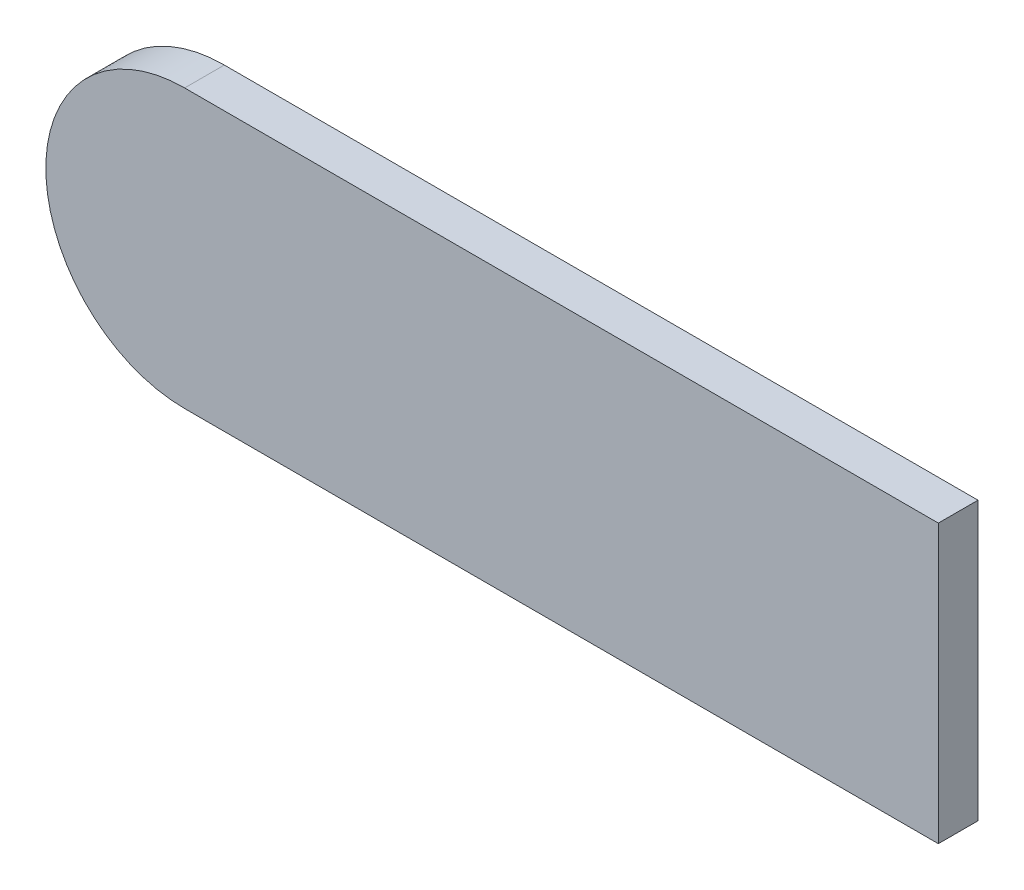
ISO-10303-21;
HEADER;
FILE_DESCRIPTION(('STEP AP214'),'2;1');
FILE_NAME('part.step','',(''),(''),'','','');
FILE_SCHEMA(('AUTOMOTIVE_DESIGN { 1 0 10303 214 1 1 1 1 }'));
ENDSEC;
DATA;
#1=APPLICATION_CONTEXT('core data for automotive mechanical design processes');
#2=APPLICATION_PROTOCOL_DEFINITION('international standard','automotive_design',2000,#1);
#3=PRODUCT_CONTEXT('',#1,'mechanical');
#4=PRODUCT('Part','Part','',(#3));
#5=PRODUCT_RELATED_PRODUCT_CATEGORY('part','',(#4));
#6=PRODUCT_DEFINITION_FORMATION('','',#4);
#7=PRODUCT_DEFINITION_CONTEXT('part definition',#1,'design');
#8=PRODUCT_DEFINITION('design','',#6,#7);
#9=PRODUCT_DEFINITION_SHAPE('','',#8);
#10=(LENGTH_UNIT() NAMED_UNIT(*) SI_UNIT(.MILLI.,.METRE.));
#11=(NAMED_UNIT(*) PLANE_ANGLE_UNIT() SI_UNIT($,.RADIAN.));
#12=(NAMED_UNIT(*) SI_UNIT($,.STERADIAN.) SOLID_ANGLE_UNIT());
#13=UNCERTAINTY_MEASURE_WITH_UNIT(LENGTH_MEASURE(1.E-05),#10,'distance_accuracy_value','');
#14=(GEOMETRIC_REPRESENTATION_CONTEXT(3) GLOBAL_UNCERTAINTY_ASSIGNED_CONTEXT((#13)) GLOBAL_UNIT_ASSIGNED_CONTEXT((#10,
#11,#12)) REPRESENTATION_CONTEXT('',''));
#15=CARTESIAN_POINT('',(0.,0.,0.));
#16=DIRECTION('',(0.,0.,1.));
#17=DIRECTION('',(1.,0.,0.));
#18=AXIS2_PLACEMENT_3D('',#15,#16,#17);
#19=CARTESIAN_POINT('',(4.24276439095261,2.65,0.));
#20=DIRECTION('',(0.,0.,1.));
#21=DIRECTION('',(1.,0.,0.));
#22=AXIS2_PLACEMENT_3D('',#19,#20,#21);
#23=PLANE('',#22);
#24=DIRECTION('',(1.,0.,0.));
#25=VECTOR('',#24,1.);
#26=CARTESIAN_POINT('',(5.3,2.3,0.));
#27=LINE('',#26,#25);
#28=CARTESIAN_POINT('',(3.4,2.3,0.));
#29=VERTEX_POINT('',#28);
#30=CARTESIAN_POINT('',(5.3,2.3,0.));
#31=VERTEX_POINT('',#30);
#32=EDGE_CURVE('E68',#29,#31,#27,.T.);
#33=ORIENTED_EDGE('',*,*,#32,.F.);
#34=CARTESIAN_POINT('',(3.4,2.65,0.));
#35=DIRECTION('',(0.,0.,-1.));
#36=DIRECTION('',(-1.,0.,0.));
#37=AXIS2_PLACEMENT_3D('',#34,#35,#36);
#38=CIRCLE('',#37,0.35);
#39=CARTESIAN_POINT('',(3.4,3.,0.));
#40=VERTEX_POINT('',#39);
#41=EDGE_CURVE('E20',#40,#29,#38,.F.);
#42=ORIENTED_EDGE('',*,*,#41,.F.);
#43=DIRECTION('',(1.,0.,0.));
#44=VECTOR('',#43,1.);
#45=CARTESIAN_POINT('',(3.4,3.,0.));
#46=LINE('',#45,#44);
#47=CARTESIAN_POINT('',(5.3,3.,0.));
#48=VERTEX_POINT('',#47);
#49=EDGE_CURVE('E89',#48,#40,#46,.F.);
#50=ORIENTED_EDGE('',*,*,#49,.F.);
#51=DIRECTION('',(0.,1.,0.));
#52=VECTOR('',#51,1.);
#53=CARTESIAN_POINT('',(5.3,3.,0.));
#54=LINE('',#53,#52);
#55=EDGE_CURVE('E57',#31,#48,#54,.T.);
#56=ORIENTED_EDGE('',*,*,#55,.F.);
#57=EDGE_LOOP('',(#33,#42,#50,#56));
#58=FACE_BOUND('',#57,.T.);
#59=ADVANCED_FACE('F17',(#58),#23,.F.);
#60=CARTESIAN_POINT('',(5.3,2.3,0.));
#61=DIRECTION('',(0.,-1.,0.));
#62=DIRECTION('',(1.,0.,0.));
#63=AXIS2_PLACEMENT_3D('',#60,#61,#62);
#64=PLANE('',#63);
#65=ORIENTED_EDGE('',*,*,#32,.T.);
#66=DIRECTION('',(0.,0.,1.));
#67=VECTOR('',#66,1.);
#68=CARTESIAN_POINT('',(5.3,2.3,0.));
#69=LINE('',#68,#67);
#70=CARTESIAN_POINT('',(5.3,2.3,0.1));
#71=VERTEX_POINT('',#70);
#72=EDGE_CURVE('E61',#71,#31,#69,.F.);
#73=ORIENTED_EDGE('',*,*,#72,.F.);
#74=DIRECTION('',(1.,0.,0.));
#75=VECTOR('',#74,1.);
#76=CARTESIAN_POINT('',(4.24276439095261,2.3,0.1));
#77=LINE('',#76,#75);
#78=CARTESIAN_POINT('',(3.4,2.3,0.1));
#79=VERTEX_POINT('',#78);
#80=EDGE_CURVE('E66',#79,#71,#77,.T.);
#81=ORIENTED_EDGE('',*,*,#80,.F.);
#82=DIRECTION('',(0.,0.,-1.));
#83=VECTOR('',#82,1.);
#84=CARTESIAN_POINT('',(3.4,2.3,0.));
#85=LINE('',#84,#83);
#86=EDGE_CURVE('E79',#29,#79,#85,.F.);
#87=ORIENTED_EDGE('',*,*,#86,.F.);
#88=EDGE_LOOP('',(#65,#73,#81,#87));
#89=FACE_BOUND('',#88,.T.);
#90=ADVANCED_FACE('F63',(#89),#64,.T.);
#91=CARTESIAN_POINT('',(5.3,3.,0.));
#92=DIRECTION('',(1.,0.,0.));
#93=DIRECTION('',(0.,1.,0.));
#94=AXIS2_PLACEMENT_3D('',#91,#92,#93);
#95=PLANE('',#94);
#96=ORIENTED_EDGE('',*,*,#55,.T.);
#97=DIRECTION('',(0.,0.,1.));
#98=VECTOR('',#97,1.);
#99=CARTESIAN_POINT('',(5.3,3.,0.));
#100=LINE('',#99,#98);
#101=CARTESIAN_POINT('',(5.3,3.,0.1));
#102=VERTEX_POINT('',#101);
#103=EDGE_CURVE('E74',#102,#48,#100,.F.);
#104=ORIENTED_EDGE('',*,*,#103,.F.);
#105=DIRECTION('',(0.,1.,0.));
#106=VECTOR('',#105,1.);
#107=CARTESIAN_POINT('',(5.3,2.65,0.1));
#108=LINE('',#107,#106);
#109=EDGE_CURVE('E71',#71,#102,#108,.T.);
#110=ORIENTED_EDGE('',*,*,#109,.F.);
#111=ORIENTED_EDGE('',*,*,#72,.T.);
#112=EDGE_LOOP('',(#96,#104,#110,#111));
#113=FACE_BOUND('',#112,.T.);
#114=ADVANCED_FACE('F72',(#113),#95,.T.);
#115=CARTESIAN_POINT('',(3.4,3.,0.));
#116=DIRECTION('',(0.,1.,0.));
#117=DIRECTION('',(0.,0.,1.));
#118=AXIS2_PLACEMENT_3D('',#115,#116,#117);
#119=PLANE('',#118);
#120=ORIENTED_EDGE('',*,*,#49,.T.);
#121=DIRECTION('',(0.,0.,-1.));
#122=VECTOR('',#121,1.);
#123=CARTESIAN_POINT('',(3.4,3.,0.));
#124=LINE('',#123,#122);
#125=CARTESIAN_POINT('',(3.4,3.,0.1));
#126=VERTEX_POINT('',#125);
#127=EDGE_CURVE('E34',#126,#40,#124,.T.);
#128=ORIENTED_EDGE('',*,*,#127,.F.);
#129=DIRECTION('',(1.,0.,0.));
#130=VECTOR('',#129,1.);
#131=CARTESIAN_POINT('',(4.24276439095261,3.,0.1));
#132=LINE('',#131,#130);
#133=EDGE_CURVE('E26',#102,#126,#132,.F.);
#134=ORIENTED_EDGE('',*,*,#133,.F.);
#135=ORIENTED_EDGE('',*,*,#103,.T.);
#136=EDGE_LOOP('',(#120,#128,#134,#135));
#137=FACE_BOUND('',#136,.T.);
#138=ADVANCED_FACE('F105',(#137),#119,.T.);
#139=CARTESIAN_POINT('',(3.4,2.65,0.));
#140=DIRECTION('',(0.,0.,-1.));
#141=DIRECTION('',(-1.,0.,0.));
#142=AXIS2_PLACEMENT_3D('',#139,#140,#141);
#143=CYLINDRICAL_SURFACE('',#142,0.35);
#144=ORIENTED_EDGE('',*,*,#41,.T.);
#145=ORIENTED_EDGE('',*,*,#86,.T.);
#146=CARTESIAN_POINT('',(3.4,2.65,0.1));
#147=DIRECTION('',(0.,0.,-1.));
#148=DIRECTION('',(-1.,0.,0.));
#149=AXIS2_PLACEMENT_3D('',#146,#147,#148);
#150=CIRCLE('',#149,0.35);
#151=EDGE_CURVE('E11',#126,#79,#150,.F.);
#152=ORIENTED_EDGE('',*,*,#151,.F.);
#153=ORIENTED_EDGE('',*,*,#127,.T.);
#154=EDGE_LOOP('',(#144,#145,#152,#153));
#155=FACE_BOUND('',#154,.T.);
#156=ADVANCED_FACE('F107',(#155),#143,.T.);
#157=CARTESIAN_POINT('',(4.24276439095261,2.65,0.1));
#158=DIRECTION('',(0.,0.,1.));
#159=DIRECTION('',(1.,0.,0.));
#160=AXIS2_PLACEMENT_3D('',#157,#158,#159);
#161=PLANE('',#160);
#162=ORIENTED_EDGE('',*,*,#133,.T.);
#163=ORIENTED_EDGE('',*,*,#151,.T.);
#164=ORIENTED_EDGE('',*,*,#80,.T.);
#165=ORIENTED_EDGE('',*,*,#109,.T.);
#166=EDGE_LOOP('',(#162,#163,#164,#165));
#167=FACE_BOUND('',#166,.T.);
#168=ADVANCED_FACE('F78',(#167),#161,.T.);
#169=CLOSED_SHELL('',(#59,#90,#114,#138,#156,#168));
#170=MANIFOLD_SOLID_BREP('B1',#169);
#171=ADVANCED_BREP_SHAPE_REPRESENTATION('',(#18,#170),#14);
#172=SHAPE_DEFINITION_REPRESENTATION(#9,#171);
ENDSEC;
END-ISO-10303-21;
